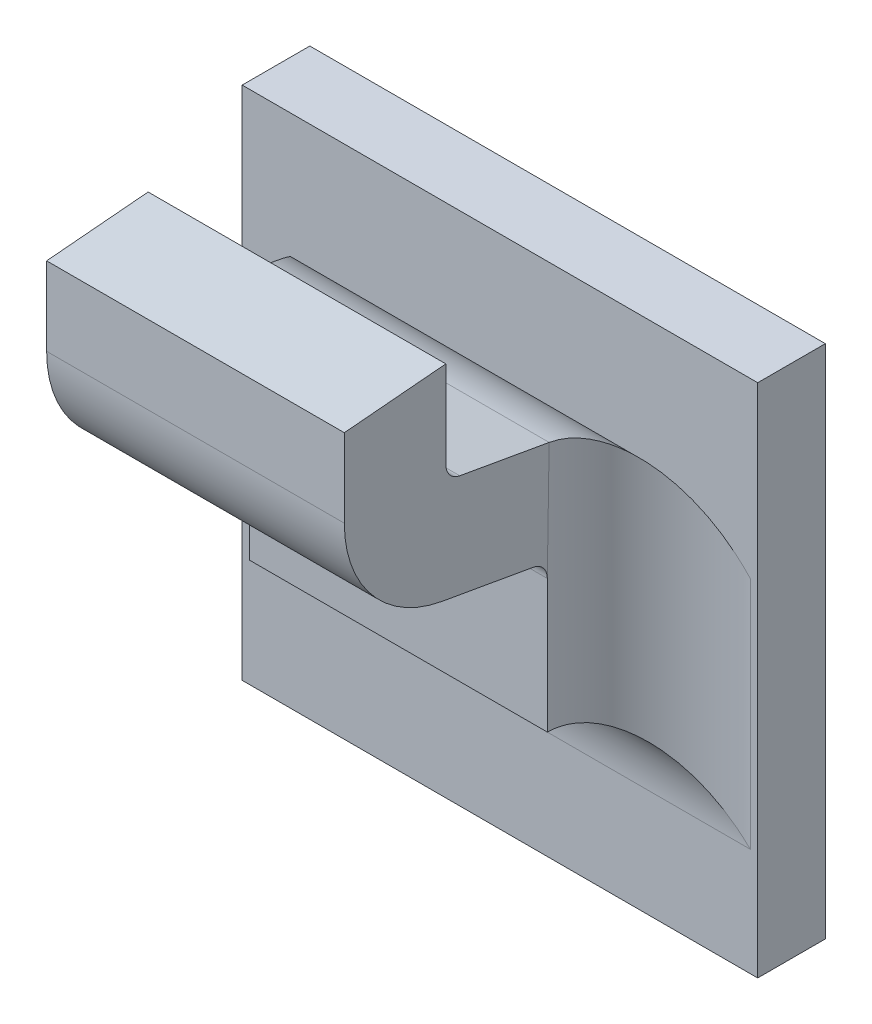
ISO-10303-21;
HEADER;
FILE_DESCRIPTION(('STEP AP214'),'2;1');
FILE_NAME('part.step','',(''),(''),'','','');
FILE_SCHEMA(('AUTOMOTIVE_DESIGN { 1 0 10303 214 1 1 1 1 }'));
ENDSEC;
DATA;
#1=APPLICATION_CONTEXT('core data for automotive mechanical design processes');
#2=APPLICATION_PROTOCOL_DEFINITION('international standard','automotive_design',2000,#1);
#3=PRODUCT_CONTEXT('',#1,'mechanical');
#4=PRODUCT('Part','Part','',(#3));
#5=PRODUCT_RELATED_PRODUCT_CATEGORY('part','',(#4));
#6=PRODUCT_DEFINITION_FORMATION('','',#4);
#7=PRODUCT_DEFINITION_CONTEXT('part definition',#1,'design');
#8=PRODUCT_DEFINITION('design','',#6,#7);
#9=PRODUCT_DEFINITION_SHAPE('','',#8);
#10=(LENGTH_UNIT() NAMED_UNIT(*) SI_UNIT(.MILLI.,.METRE.));
#11=(NAMED_UNIT(*) PLANE_ANGLE_UNIT() SI_UNIT($,.RADIAN.));
#12=(NAMED_UNIT(*) SI_UNIT($,.STERADIAN.) SOLID_ANGLE_UNIT());
#13=UNCERTAINTY_MEASURE_WITH_UNIT(LENGTH_MEASURE(1.E-05),#10,'distance_accuracy_value','');
#14=(GEOMETRIC_REPRESENTATION_CONTEXT(3) GLOBAL_UNCERTAINTY_ASSIGNED_CONTEXT((#13)) GLOBAL_UNIT_ASSIGNED_CONTEXT((#10,
#11,#12)) REPRESENTATION_CONTEXT('',''));
#15=CARTESIAN_POINT('',(0.,0.,0.));
#16=DIRECTION('',(0.,0.,1.));
#17=DIRECTION('',(1.,0.,0.));
#18=AXIS2_PLACEMENT_3D('',#15,#16,#17);
#19=CARTESIAN_POINT('',(0.804111518349957,-0.481298710143328,0.0797514586291467));
#20=DIRECTION('',(1.,0.,0.));
#21=DIRECTION('',(0.,1.,0.));
#22=AXIS2_PLACEMENT_3D('',#19,#20,#21);
#23=CYLINDRICAL_SURFACE('',#22,0.00098425196850394);
#24=DIRECTION('',(1.,0.,0.));
#25=VECTOR('',#24,1.);
#26=CARTESIAN_POINT('',(0.785056400239721,-0.481298710143328,0.0807357105976507));
#27=LINE('',#26,#25);
#28=CARTESIAN_POINT('',(0.803245376617673,-0.481298710143328,0.0807357105976507));
#29=VERTEX_POINT('',#28);
#30=CARTESIAN_POINT('',(0.785922541972004,-0.481298710143328,0.0807357105976507));
#31=VERTEX_POINT('',#30);
#32=EDGE_CURVE('E182',#29,#31,#27,.F.);
#33=ORIENTED_EDGE('',*,*,#32,.F.);
#34=CARTESIAN_POINT('',(0.803245376617673,-0.481298710143328,0.0797514586291467));
#35=DIRECTION('',(1.,0.,0.));
#36=DIRECTION('',(0.,1.,0.));
#37=AXIS2_PLACEMENT_3D('',#34,#35,#36);
#38=CIRCLE('',#37,0.00098425196850394);
#39=CARTESIAN_POINT('',(0.803245376617673,-0.482268009112829,0.0799223721898426));
#40=VERTEX_POINT('',#39);
#41=EDGE_CURVE('E155',#40,#29,#38,.F.);
#42=ORIENTED_EDGE('',*,*,#41,.F.);
#43=DIRECTION('',(1.,0.,0.));
#44=VECTOR('',#43,1.);
#45=CARTESIAN_POINT('',(0.785052207455063,-0.482268009112829,0.0799223721898425));
#46=LINE('',#45,#44);
#47=CARTESIAN_POINT('',(0.785922541972004,-0.482268009112829,0.0799223721898426));
#48=VERTEX_POINT('',#47);
#49=EDGE_CURVE('E137',#48,#40,#46,.T.);
#50=ORIENTED_EDGE('',*,*,#49,.F.);
#51=CARTESIAN_POINT('',(0.785922541972004,-0.481298710143328,0.0797514586291467));
#52=DIRECTION('',(1.,0.,0.));
#53=DIRECTION('',(0.,1.,0.));
#54=AXIS2_PLACEMENT_3D('',#51,#52,#53);
#55=CIRCLE('',#54,0.00098425196850394);
#56=EDGE_CURVE('E148',#48,#31,#55,.F.);
#57=ORIENTED_EDGE('',*,*,#56,.T.);
#58=EDGE_LOOP('',(#33,#42,#50,#57));
#59=FACE_BOUND('',#58,.T.);
#60=ADVANCED_FACE('F17',(#59),#23,.F.);
#61=CARTESIAN_POINT('',(0.785056400239721,-0.481552552937204,0.0807357105976507));
#62=DIRECTION('',(0.,0.,-1.));
#63=DIRECTION('',(0.,1.,0.));
#64=AXIS2_PLACEMENT_3D('',#61,#62,#63);
#65=PLANE('',#64);
#66=ORIENTED_EDGE('',*,*,#32,.T.);
#67=DIRECTION('',(0.,1.,0.));
#68=VECTOR('',#67,1.);
#69=CARTESIAN_POINT('',(0.785922541972004,-0.490676723073834,0.0807357105976507));
#70=LINE('',#69,#68);
#71=CARTESIAN_POINT('',(0.785922541972004,-0.476221854265821,0.0807357105976507));
#72=VERTEX_POINT('',#71);
#73=EDGE_CURVE('E177',#31,#72,#70,.T.);
#74=ORIENTED_EDGE('',*,*,#73,.T.);
#75=DIRECTION('',(1.,0.,0.));
#76=VECTOR('',#75,1.);
#77=CARTESIAN_POINT('',(0.832083959294839,-0.476221854265822,0.0807357105976506));
#78=LINE('',#77,#76);
#79=CARTESIAN_POINT('',(0.803245376617673,-0.476221854265821,0.0807357105976507));
#80=VERTEX_POINT('',#79);
#81=EDGE_CURVE('E170',#72,#80,#78,.T.);
#82=ORIENTED_EDGE('',*,*,#81,.T.);
#83=DIRECTION('',(0.,1.,0.));
#84=VECTOR('',#83,1.);
#85=CARTESIAN_POINT('',(0.803245376617673,-0.490676723073834,0.0807357105976507));
#86=LINE('',#85,#84);
#87=EDGE_CURVE('E189',#29,#80,#86,.T.);
#88=ORIENTED_EDGE('',*,*,#87,.F.);
#89=EDGE_LOOP('',(#66,#74,#82,#88));
#90=FACE_BOUND('',#89,.T.);
#91=ADVANCED_FACE('F376',(#90),#65,.T.);
#92=CARTESIAN_POINT('',(0.832083959294839,-0.476580451683761,0.0848344978403345));
#93=DIRECTION('',(0.,-0.996194698091746,-0.0871557427476516));
#94=DIRECTION('',(0.,0.0871557427476516,-0.996194698091746));
#95=AXIS2_PLACEMENT_3D('',#92,#93,#94);
#96=PLANE('',#95);
#97=DIRECTION('',(0.,-0.0871557427476629,0.996194698091745));
#98=VECTOR('',#97,1.);
#99=CARTESIAN_POINT('',(0.785922541972004,-0.476221854265821,0.0807357105976507));
#100=LINE('',#99,#98);
#101=CARTESIAN_POINT('',(0.785922541972004,-0.476738519601604,0.0866412224086743));
#102=VERTEX_POINT('',#101);
#103=EDGE_CURVE('E173',#72,#102,#100,.T.);
#104=ORIENTED_EDGE('',*,*,#103,.T.);
#105=DIRECTION('',(1.,0.,0.));
#106=VECTOR('',#105,1.);
#107=CARTESIAN_POINT('',(0.785056400239721,-0.476738519601604,0.0866412224086743));
#108=LINE('',#107,#106);
#109=CARTESIAN_POINT('',(0.803245376617673,-0.476738519601604,0.0866412224086743));
#110=VERTEX_POINT('',#109);
#111=EDGE_CURVE('E167',#102,#110,#108,.T.);
#112=ORIENTED_EDGE('',*,*,#111,.T.);
#113=DIRECTION('',(0.,-0.0871557427476629,0.996194698091745));
#114=VECTOR('',#113,1.);
#115=CARTESIAN_POINT('',(0.803245376617673,-0.476221854265821,0.0807357105976507));
#116=LINE('',#115,#114);
#117=EDGE_CURVE('E186',#80,#110,#116,.T.);
#118=ORIENTED_EDGE('',*,*,#117,.F.);
#119=ORIENTED_EDGE('',*,*,#81,.F.);
#120=EDGE_LOOP('',(#104,#112,#118,#119));
#121=FACE_BOUND('',#120,.T.);
#122=ADVANCED_FACE('F380',(#121),#96,.F.);
#123=CARTESIAN_POINT('',(0.785056400239721,-0.481526719670415,0.0866412224086743));
#124=DIRECTION('',(0.,0.,-1.));
#125=DIRECTION('',(0.,1.,0.));
#126=AXIS2_PLACEMENT_3D('',#123,#124,#125);
#127=PLANE('',#126);
#128=ORIENTED_EDGE('',*,*,#111,.F.);
#129=DIRECTION('',(0.,1.,0.));
#130=VECTOR('',#129,1.);
#131=CARTESIAN_POINT('',(0.785922541972004,-0.490676723073834,0.0866412224086743));
#132=LINE('',#131,#130);
#133=CARTESIAN_POINT('',(0.785922541972004,-0.481298710143328,0.0866412224086743));
#134=VERTEX_POINT('',#133);
#135=EDGE_CURVE('E176',#102,#134,#132,.F.);
#136=ORIENTED_EDGE('',*,*,#135,.T.);
#137=DIRECTION('',(1.,0.,0.));
#138=VECTOR('',#137,1.);
#139=CARTESIAN_POINT('',(0.804111518349957,-0.481298710143328,0.0866412224086743));
#140=LINE('',#139,#138);
#141=CARTESIAN_POINT('',(0.803245376617673,-0.481298710143328,0.0866412224086743));
#142=VERTEX_POINT('',#141);
#143=EDGE_CURVE('E165',#142,#134,#140,.F.);
#144=ORIENTED_EDGE('',*,*,#143,.F.);
#145=DIRECTION('',(0.,1.,0.));
#146=VECTOR('',#145,1.);
#147=CARTESIAN_POINT('',(0.803245376617673,-0.490676723073834,0.0866412224086743));
#148=LINE('',#147,#146);
#149=EDGE_CURVE('E188',#110,#142,#148,.F.);
#150=ORIENTED_EDGE('',*,*,#149,.F.);
#151=EDGE_LOOP('',(#128,#136,#144,#150));
#152=FACE_BOUND('',#151,.T.);
#153=ADVANCED_FACE('F384',(#152),#127,.F.);
#154=CARTESIAN_POINT('',(0.804111518349957,-0.481298710143328,0.0797514586291467));
#155=DIRECTION('',(1.,0.,0.));
#156=DIRECTION('',(0.,1.,0.));
#157=AXIS2_PLACEMENT_3D('',#154,#155,#156);
#158=CYLINDRICAL_SURFACE('',#157,0.00688976377952756);
#159=CARTESIAN_POINT('',(0.803245376617673,-0.481298710143328,0.0797514586291467));
#160=DIRECTION('',(1.,0.,0.));
#161=DIRECTION('',(0.,1.,0.));
#162=AXIS2_PLACEMENT_3D('',#159,#160,#161);
#163=CIRCLE('',#162,0.00688976377952756);
#164=CARTESIAN_POINT('',(0.803245376617673,-0.48808380292983,0.0809478535540176));
#165=VERTEX_POINT('',#164);
#166=EDGE_CURVE('E146',#142,#165,#163,.T.);
#167=ORIENTED_EDGE('',*,*,#166,.F.);
#168=ORIENTED_EDGE('',*,*,#143,.T.);
#169=CARTESIAN_POINT('',(0.785922541972004,-0.481298710143328,0.0797514586291467));
#170=DIRECTION('',(1.,0.,0.));
#171=DIRECTION('',(0.,1.,0.));
#172=AXIS2_PLACEMENT_3D('',#169,#170,#171);
#173=CIRCLE('',#172,0.00688976377952756);
#174=CARTESIAN_POINT('',(0.785922541972004,-0.48808380292983,0.0809478535540176));
#175=VERTEX_POINT('',#174);
#176=EDGE_CURVE('E235',#134,#175,#173,.T.);
#177=ORIENTED_EDGE('',*,*,#176,.T.);
#178=DIRECTION('',(1.,0.,0.));
#179=VECTOR('',#178,1.);
#180=CARTESIAN_POINT('',(0.785056400239721,-0.48808380292983,0.0809478535540173));
#181=LINE('',#180,#179);
#182=EDGE_CURVE('E138',#175,#165,#181,.T.);
#183=ORIENTED_EDGE('',*,*,#182,.T.);
#184=EDGE_LOOP('',(#167,#168,#177,#183));
#185=FACE_BOUND('',#184,.T.);
#186=ADVANCED_FACE('F388',(#185),#158,.T.);
#187=CARTESIAN_POINT('',(0.785056400239721,-0.489065861722658,0.075378321376456));
#188=DIRECTION('',(0.,0.984807753012208,-0.17364817766693));
#189=DIRECTION('',(0.,0.17364817766693,0.984807753012208));
#190=AXIS2_PLACEMENT_3D('',#187,#188,#189);
#191=PLANE('',#190);
#192=DIRECTION('',(1.,0.,0.));
#193=VECTOR('',#192,1.);
#194=CARTESIAN_POINT('',(0.804111518349957,-0.489019097018238,0.0756435371944352));
#195=LINE('',#194,#193);
#196=CARTESIAN_POINT('',(0.785922541972004,-0.489019097018238,0.0756435371944351));
#197=VERTEX_POINT('',#196);
#198=CARTESIAN_POINT('',(0.803245376617673,-0.489019097018238,0.0756435371944351));
#199=VERTEX_POINT('',#198);
#200=EDGE_CURVE('E127',#197,#199,#195,.T.);
#201=ORIENTED_EDGE('',*,*,#200,.T.);
#202=DIRECTION('',(0.,-0.173648177666998,-0.984807753012196));
#203=VECTOR('',#202,1.);
#204=CARTESIAN_POINT('',(0.803245376617673,-0.48808380292983,0.0809478535540173));
#205=LINE('',#204,#203);
#206=EDGE_CURVE('E130',#165,#199,#205,.T.);
#207=ORIENTED_EDGE('',*,*,#206,.F.);
#208=ORIENTED_EDGE('',*,*,#182,.F.);
#209=DIRECTION('',(0.,-0.173648177666998,-0.984807753012196));
#210=VECTOR('',#209,1.);
#211=CARTESIAN_POINT('',(0.785922541972004,-0.48808380292983,0.0809478535540173));
#212=LINE('',#211,#210);
#213=EDGE_CURVE('E132',#175,#197,#212,.T.);
#214=ORIENTED_EDGE('',*,*,#213,.T.);
#215=EDGE_LOOP('',(#201,#207,#208,#214));
#216=FACE_BOUND('',#215,.T.);
#217=ADVANCED_FACE('F129',(#216),#191,.F.);
#218=CARTESIAN_POINT('',(0.804111518349957,-0.489988395987738,0.0758144507551309));
#219=DIRECTION('',(1.,0.,0.));
#220=DIRECTION('',(0.,1.,0.));
#221=AXIS2_PLACEMENT_3D('',#218,#219,#220);
#222=CYLINDRICAL_SURFACE('',#221,0.00098425196850394);
#223=DIRECTION('',(1.,0.,0.));
#224=VECTOR('',#223,1.);
#225=CARTESIAN_POINT('',(0.785056400239721,-0.489988395987738,0.074830198786627));
#226=LINE('',#225,#224);
#227=CARTESIAN_POINT('',(0.785922541972004,-0.489988395987738,0.074830198786627));
#228=VERTEX_POINT('',#227);
#229=CARTESIAN_POINT('',(0.803245376617673,-0.489988395987738,0.074830198786627));
#230=VERTEX_POINT('',#229);
#231=EDGE_CURVE('E151',#228,#230,#226,.T.);
#232=ORIENTED_EDGE('',*,*,#231,.T.);
#233=CARTESIAN_POINT('',(0.803245376617673,-0.489988395987738,0.0758144507551309));
#234=DIRECTION('',(1.,0.,0.));
#235=DIRECTION('',(0.,1.,0.));
#236=AXIS2_PLACEMENT_3D('',#233,#234,#235);
#237=CIRCLE('',#236,0.00098425196850394);
#238=EDGE_CURVE('E20',#199,#230,#237,.F.);
#239=ORIENTED_EDGE('',*,*,#238,.F.);
#240=ORIENTED_EDGE('',*,*,#200,.F.);
#241=CARTESIAN_POINT('',(0.785922541972004,-0.489988395987738,0.0758144507551309));
#242=DIRECTION('',(1.,0.,0.));
#243=DIRECTION('',(0.,1.,0.));
#244=AXIS2_PLACEMENT_3D('',#241,#242,#243);
#245=CIRCLE('',#244,0.00098425196850394);
#246=EDGE_CURVE('E232',#197,#228,#245,.F.);
#247=ORIENTED_EDGE('',*,*,#246,.T.);
#248=EDGE_LOOP('',(#232,#239,#240,#247));
#249=FACE_BOUND('',#248,.T.);
#250=ADVANCED_FACE('F150',(#249),#222,.F.);
#251=CARTESIAN_POINT('',(0.785052207455063,-0.483250067905657,0.0743528400122813));
#252=DIRECTION('',(0.,0.984807753012208,-0.17364817766693));
#253=DIRECTION('',(0.,0.17364817766693,0.984807753012208));
#254=AXIS2_PLACEMENT_3D('',#251,#252,#253);
#255=PLANE('',#254);
#256=DIRECTION('',(0.,0.173648177666945,0.984807753012206));
#257=VECTOR('',#256,1.);
#258=CARTESIAN_POINT('',(0.803245376617673,-0.483165896674262,0.074830198786627));
#259=LINE('',#258,#257);
#260=CARTESIAN_POINT('',(0.803247282428882,-0.483184599937749,0.0747241273084437));
#261=VERTEX_POINT('',#260);
#262=EDGE_CURVE('E153',#261,#40,#259,.T.);
#263=ORIENTED_EDGE('',*,*,#262,.F.);
#264=DIRECTION('',(1.,0.,0.));
#265=VECTOR('',#264,1.);
#266=CARTESIAN_POINT('',(0.810607581342083,-0.483203303201237,0.0746180558302605));
#267=LINE('',#266,#265);
#268=CARTESIAN_POINT('',(0.785920636160796,-0.483184599937749,0.0747241273084437));
#269=VERTEX_POINT('',#268);
#270=EDGE_CURVE('E264',#269,#261,#267,.T.);
#271=ORIENTED_EDGE('',*,*,#270,.F.);
#272=DIRECTION('',(0.,0.173648177666945,0.984807753012206));
#273=VECTOR('',#272,1.);
#274=CARTESIAN_POINT('',(0.785922541972004,-0.483165896674262,0.074830198786627));
#275=LINE('',#274,#273);
#276=EDGE_CURVE('E234',#269,#48,#275,.T.);
#277=ORIENTED_EDGE('',*,*,#276,.T.);
#278=ORIENTED_EDGE('',*,*,#49,.T.);
#279=EDGE_LOOP('',(#263,#271,#277,#278));
#280=FACE_BOUND('',#279,.T.);
#281=ADVANCED_FACE('F373',(#280),#255,.T.);
#282=CARTESIAN_POINT('',(0.803245376617673,-0.490676723073834,0.0742396476055247));
#283=DIRECTION('',(1.,0.,0.));
#284=DIRECTION('',(0.,1.,0.));
#285=AXIS2_PLACEMENT_3D('',#282,#283,#284);
#286=PLANE('',#285);
#287=ORIENTED_EDGE('',*,*,#166,.T.);
#288=ORIENTED_EDGE('',*,*,#206,.T.);
#289=ORIENTED_EDGE('',*,*,#238,.T.);
#290=DIRECTION('',(0.,-1.,0.));
#291=VECTOR('',#290,1.);
#292=CARTESIAN_POINT('',(0.803245376617673,-0.504660414832431,0.074830198786627));
#293=LINE('',#292,#291);
#294=EDGE_CURVE('E271',#230,#261,#293,.F.);
#295=ORIENTED_EDGE('',*,*,#294,.T.);
#296=ORIENTED_EDGE('',*,*,#262,.T.);
#297=ORIENTED_EDGE('',*,*,#41,.T.);
#298=ORIENTED_EDGE('',*,*,#87,.T.);
#299=ORIENTED_EDGE('',*,*,#117,.T.);
#300=ORIENTED_EDGE('',*,*,#149,.T.);
#301=EDGE_LOOP('',(#287,#288,#289,#295,#296,#297,#298,#299,#300));
#302=FACE_BOUND('',#301,.T.);
#303=ADVANCED_FACE('F142',(#302),#286,.T.);
#304=CARTESIAN_POINT('',(0.785922541972004,-0.490676723073834,0.0742396476055247));
#305=DIRECTION('',(1.,0.,0.));
#306=DIRECTION('',(0.,1.,0.));
#307=AXIS2_PLACEMENT_3D('',#304,#305,#306);
#308=PLANE('',#307);
#309=DIRECTION('',(0.,1.,0.));
#310=VECTOR('',#309,1.);
#311=CARTESIAN_POINT('',(0.785922541972005,-0.482142348190539,0.074830198786627));
#312=LINE('',#311,#310);
#313=EDGE_CURVE('E290',#269,#228,#312,.F.);
#314=ORIENTED_EDGE('',*,*,#313,.T.);
#315=ORIENTED_EDGE('',*,*,#246,.F.);
#316=ORIENTED_EDGE('',*,*,#213,.F.);
#317=ORIENTED_EDGE('',*,*,#176,.F.);
#318=ORIENTED_EDGE('',*,*,#135,.F.);
#319=ORIENTED_EDGE('',*,*,#103,.F.);
#320=ORIENTED_EDGE('',*,*,#73,.F.);
#321=ORIENTED_EDGE('',*,*,#56,.F.);
#322=ORIENTED_EDGE('',*,*,#276,.F.);
#323=EDGE_LOOP('',(#314,#315,#316,#317,#318,#319,#320,#321,#322));
#324=FACE_BOUND('',#323,.T.);
#325=ADVANCED_FACE('F371',(#324),#308,.F.);
#326=CARTESIAN_POINT('',(0.785056400239721,-0.498118502465182,0.074830198786627));
#327=DIRECTION('',(0.,0.,-1.));
#328=DIRECTION('',(0.,1.,0.));
#329=AXIS2_PLACEMENT_3D('',#326,#327,#328);
#330=PLANE('',#329);
#331=DIRECTION('',(-1.,0.,0.));
#332=VECTOR('',#331,1.);
#333=CARTESIAN_POINT('',(0.778560337247595,-0.497731354537685,0.074830198786627));
#334=LINE('',#333,#332);
#335=CARTESIAN_POINT('',(0.785922541972005,-0.497731354537685,0.074830198786627));
#336=VERTEX_POINT('',#335);
#337=CARTESIAN_POINT('',(0.803245376617673,-0.497731354537685,0.074830198786627));
#338=VERTEX_POINT('',#337);
#339=EDGE_CURVE('E275',#336,#338,#334,.F.);
#340=ORIENTED_EDGE('',*,*,#339,.T.);
#341=DIRECTION('',(0.,-1.,0.));
#342=VECTOR('',#341,1.);
#343=CARTESIAN_POINT('',(0.803245376617673,-0.504660414832431,0.074830198786627));
#344=LINE('',#343,#342);
#345=EDGE_CURVE('E268',#338,#230,#344,.F.);
#346=ORIENTED_EDGE('',*,*,#345,.T.);
#347=ORIENTED_EDGE('',*,*,#231,.F.);
#348=DIRECTION('',(0.,1.,0.));
#349=VECTOR('',#348,1.);
#350=CARTESIAN_POINT('',(0.785922541972005,-0.482142348190539,0.074830198786627));
#351=LINE('',#350,#349);
#352=EDGE_CURVE('E293',#228,#336,#351,.F.);
#353=ORIENTED_EDGE('',*,*,#352,.T.);
#354=EDGE_LOOP('',(#340,#346,#347,#353));
#355=FACE_BOUND('',#354,.T.);
#356=ADVANCED_FACE('F369',(#355),#330,.F.);
#357=CARTESIAN_POINT('',(0.810607581342083,-0.489988395987738,0.0758144507551309));
#358=DIRECTION('',(1.,0.,0.));
#359=DIRECTION('',(0.,1.,0.));
#360=AXIS2_PLACEMENT_3D('',#357,#358,#359);
#361=CYLINDRICAL_SURFACE('',#360,0.00688976377952756);
#362=ORIENTED_EDGE('',*,*,#270,.T.);
#363=CARTESIAN_POINT('',(0.803246382593822,-0.483185488579863,0.0747242535477702));
#364=CARTESIAN_POINT('',(0.803251281941989,-0.483232266027787,0.0744293553553975));
#365=CARTESIAN_POINT('',(0.803278884572725,-0.483298823939585,0.0741391660738234));
#366=CARTESIAN_POINT('',(0.803372824924848,-0.483465339173825,0.0735779766513714));
#367=CARTESIAN_POINT('',(0.803438794444158,-0.483564975201296,0.073306821195812));
#368=CARTESIAN_POINT('',(0.803602778162369,-0.483792090427846,0.0727887375004896));
#369=CARTESIAN_POINT('',(0.803700655286948,-0.483919449764025,0.0725417113993396));
#370=CARTESIAN_POINT('',(0.80392225674358,-0.484196815183936,0.0720726852306902));
#371=CARTESIAN_POINT('',(0.804046047828158,-0.484346879471711,0.071850752120349));
#372=CARTESIAN_POINT('',(0.804382315788507,-0.484745897905248,0.071326423454796));
#373=CARTESIAN_POINT('',(0.804607765363316,-0.485006169183649,0.0710409452665381));
#374=CARTESIAN_POINT('',(0.805089841992869,-0.485553804988474,0.0705281886247574));
#375=CARTESIAN_POINT('',(0.805346540514468,-0.485841231269787,0.0703010474198589));
#376=CARTESIAN_POINT('',(0.805980590718541,-0.486544894865211,0.0698267645837302));
#377=CARTESIAN_POINT('',(0.806367179348041,-0.486969125966213,0.0696038752443972));
#378=CARTESIAN_POINT('',(0.807161035516566,-0.487835246032007,0.0692531254101266));
#379=CARTESIAN_POINT('',(0.807568287311545,-0.488277121499792,0.0691251936913979));
#380=CARTESIAN_POINT('',(0.808249955199605,-0.489015004077301,0.0689873300019178));
#381=CARTESIAN_POINT('',(0.808521835079522,-0.489308858114222,0.06895193709532));
#382=CARTESIAN_POINT('',(0.808913068498066,-0.489731521036954,0.0689282813392202));
#383=CARTESIAN_POINT('',(0.809031983925357,-0.48985996419474,0.0689246964591274));
#384=CARTESIAN_POINT('',(0.809150888428697,-0.489988395987738,0.0689246869756034));
#385=B_SPLINE_CURVE_WITH_KNOTS('',3,(#363,#364,#365,#366,#367,#368,#369,#370,#371,#372,#373,
#374,#375,#376,#377,#378,#379,#380,#381,#382,#383,#384),.UNSPECIFIED.,.F.,.F.,(4,2,2,2,2,2,2,2,
2,2,4),(0.,0.000892674275674722,0.00177691981761756,0.00265741564566986,0.00354020811045539,
0.00487460341316188,0.00621210995073968,0.00804949445936676,0.00988549942521242,0.011089431284,
0.0116145091100796),.UNSPECIFIED.);
#386=CARTESIAN_POINT('',(0.809150888428697,-0.489988395987738,0.0689246869756034));
#387=VERTEX_POINT('',#386);
#388=EDGE_CURVE('E231',#261,#387,#385,.T.);
#389=ORIENTED_EDGE('',*,*,#388,.T.);
#390=DIRECTION('',(1.,0.,0.));
#391=VECTOR('',#390,1.);
#392=CARTESIAN_POINT('',(0.778083959294839,-0.489988395987738,0.0689246869756034));
#393=LINE('',#392,#391);
#394=CARTESIAN_POINT('',(0.780017030160981,-0.489988395987738,0.0689246869756034));
#395=VERTEX_POINT('',#394);
#396=EDGE_CURVE('E195',#395,#387,#393,.T.);
#397=ORIENTED_EDGE('',*,*,#396,.F.);
#398=CARTESIAN_POINT('',(0.785921535995856,-0.483185488579863,0.0747242535477702));
#399=CARTESIAN_POINT('',(0.785916636647689,-0.483232266027787,0.0744293553553975));
#400=CARTESIAN_POINT('',(0.785889034016953,-0.483298823939585,0.0741391660738235));
#401=CARTESIAN_POINT('',(0.78579509366483,-0.483465339173825,0.0735779766513714));
#402=CARTESIAN_POINT('',(0.78572912414552,-0.483564975201296,0.073306821195812));
#403=CARTESIAN_POINT('',(0.785565140427309,-0.483792090427847,0.0727887375004896));
#404=CARTESIAN_POINT('',(0.78546726330273,-0.483919449764025,0.0725417113993395));
#405=CARTESIAN_POINT('',(0.785245661846098,-0.484196815183936,0.0720726852306902));
#406=CARTESIAN_POINT('',(0.78512187076152,-0.484346879471711,0.071850752120349));
#407=CARTESIAN_POINT('',(0.784785602801171,-0.484745897905248,0.071326423454796));
#408=CARTESIAN_POINT('',(0.784560153226362,-0.485006169183649,0.0710409452665381));
#409=CARTESIAN_POINT('',(0.784078076596809,-0.485553804988474,0.0705281886247574));
#410=CARTESIAN_POINT('',(0.78382137807521,-0.485841231269787,0.0703010474198589));
#411=CARTESIAN_POINT('',(0.783187327871138,-0.486544894865211,0.0698267645837302));
#412=CARTESIAN_POINT('',(0.782800739241637,-0.486969125966213,0.0696038752443972));
#413=CARTESIAN_POINT('',(0.782006883073112,-0.487835246032007,0.0692531254101267));
#414=CARTESIAN_POINT('',(0.781599631278133,-0.488277121499792,0.0691251936913979));
#415=CARTESIAN_POINT('',(0.780917963390073,-0.489015004077301,0.0689873300019178));
#416=CARTESIAN_POINT('',(0.780646083510156,-0.489308858114222,0.06895193709532));
#417=CARTESIAN_POINT('',(0.780254850091612,-0.489731521036954,0.0689282813392202));
#418=CARTESIAN_POINT('',(0.780135934664321,-0.48985996419474,0.0689246964591274));
#419=CARTESIAN_POINT('',(0.780017030160981,-0.489988395987738,0.0689246869756034));
#420=B_SPLINE_CURVE_WITH_KNOTS('',3,(#398,#399,#400,#401,#402,#403,#404,#405,#406,#407,#408,
#409,#410,#411,#412,#413,#414,#415,#416,#417,#418,#419),.UNSPECIFIED.,.F.,.F.,(4,2,2,2,2,2,2,2,
2,2,4),(0.,0.000892674275674695,0.00177691981761756,0.00265741564566996,0.0035402081104554,
0.0048746034131619,0.00621210995073963,0.00804949445936662,0.00988549942521236,
0.0110894312840001,0.0116145091100796),.UNSPECIFIED.);
#421=EDGE_CURVE('E192',#395,#269,#420,.F.);
#422=ORIENTED_EDGE('',*,*,#421,.T.);
#423=EDGE_LOOP('',(#362,#389,#397,#422));
#424=FACE_BOUND('',#423,.T.);
#425=ADVANCED_FACE('F205',(#424),#361,.T.);
#426=CARTESIAN_POINT('',(0.809150888428697,-0.504660414832431,0.074830198786627));
#427=DIRECTION('',(0.,-1.,0.));
#428=DIRECTION('',(1.,0.,0.));
#429=AXIS2_PLACEMENT_3D('',#426,#427,#428);
#430=CYLINDRICAL_SURFACE('',#429,0.00590551181102362);
#431=ORIENTED_EDGE('',*,*,#345,.F.);
#432=CARTESIAN_POINT('',(0.809150888428697,-0.503636866348709,0.074830198786627));
#433=DIRECTION('',(-0.707106781186548,-0.707106781186547,0.));
#434=DIRECTION('',(0.707106781186547,-0.707106781186548,0.));
#435=AXIS2_PLACEMENT_3D('',#432,#433,#434);
#436=ELLIPSE('',#435,0.0083516548959041,0.00590551181102362);
#437=CARTESIAN_POINT('',(0.809150888428697,-0.503636866348709,0.0689246869756034));
#438=VERTEX_POINT('',#437);
#439=EDGE_CURVE('E281',#338,#438,#436,.T.);
#440=ORIENTED_EDGE('',*,*,#439,.T.);
#441=DIRECTION('',(0.,-1.,0.));
#442=VECTOR('',#441,1.);
#443=CARTESIAN_POINT('',(0.809150888428697,-0.478408111823491,0.0689246869756034));
#444=LINE('',#443,#442);
#445=EDGE_CURVE('E276',#387,#438,#444,.T.);
#446=ORIENTED_EDGE('',*,*,#445,.F.);
#447=ORIENTED_EDGE('',*,*,#388,.F.);
#448=ORIENTED_EDGE('',*,*,#294,.F.);
#449=EDGE_LOOP('',(#431,#440,#446,#447,#448));
#450=FACE_BOUND('',#449,.T.);
#451=ADVANCED_FACE('F219',(#450),#430,.F.);
#452=CARTESIAN_POINT('',(0.778560337247595,-0.503636866348709,0.074830198786627));
#453=DIRECTION('',(-1.,0.,0.));
#454=DIRECTION('',(0.,-1.,0.));
#455=AXIS2_PLACEMENT_3D('',#452,#453,#454);
#456=CYLINDRICAL_SURFACE('',#455,0.00590551181102362);
#457=DIRECTION('',(1.,0.,0.));
#458=VECTOR('',#457,1.);
#459=CARTESIAN_POINT('',(0.778083959294839,-0.503636866348709,0.0689246869756034));
#460=LINE('',#459,#458);
#461=CARTESIAN_POINT('',(0.780017030160981,-0.503636866348709,0.0689246869756034));
#462=VERTEX_POINT('',#461);
#463=EDGE_CURVE('E278',#438,#462,#460,.F.);
#464=ORIENTED_EDGE('',*,*,#463,.F.);
#465=ORIENTED_EDGE('',*,*,#439,.F.);
#466=ORIENTED_EDGE('',*,*,#339,.F.);
#467=CARTESIAN_POINT('',(0.780017030160981,-0.503636866348709,0.074830198786627));
#468=DIRECTION('',(-0.707106781186547,0.707106781186548,0.));
#469=DIRECTION('',(-0.707106781186548,-0.707106781186547,0.));
#470=AXIS2_PLACEMENT_3D('',#467,#468,#469);
#471=ELLIPSE('',#470,0.0083516548959041,0.00590551181102362);
#472=EDGE_CURVE('E196',#336,#462,#471,.T.);
#473=ORIENTED_EDGE('',*,*,#472,.T.);
#474=EDGE_LOOP('',(#464,#465,#466,#473));
#475=FACE_BOUND('',#474,.T.);
#476=ADVANCED_FACE('F215',(#475),#456,.F.);
#477=CARTESIAN_POINT('',(0.780017030160981,-0.482142348190539,0.074830198786627));
#478=DIRECTION('',(0.,1.,0.));
#479=DIRECTION('',(-1.,0.,0.));
#480=AXIS2_PLACEMENT_3D('',#477,#478,#479);
#481=CYLINDRICAL_SURFACE('',#480,0.00590551181102362);
#482=DIRECTION('',(0.,-1.,0.));
#483=VECTOR('',#482,1.);
#484=CARTESIAN_POINT('',(0.780017030160981,-0.478408111823491,0.0689246869756034));
#485=LINE('',#484,#483);
#486=EDGE_CURVE('E283',#462,#395,#485,.F.);
#487=ORIENTED_EDGE('',*,*,#486,.F.);
#488=ORIENTED_EDGE('',*,*,#472,.F.);
#489=ORIENTED_EDGE('',*,*,#352,.F.);
#490=ORIENTED_EDGE('',*,*,#313,.F.);
#491=ORIENTED_EDGE('',*,*,#421,.F.);
#492=EDGE_LOOP('',(#487,#488,#489,#490,#491));
#493=FACE_BOUND('',#492,.T.);
#494=ADVANCED_FACE('F209',(#493),#481,.F.);
#495=CARTESIAN_POINT('',(0.778083959294839,-0.478408111823491,0.0689246869756034));
#496=DIRECTION('',(0.,0.,1.));
#497=DIRECTION('',(0.,-1.,0.));
#498=AXIS2_PLACEMENT_3D('',#495,#496,#497);
#499=PLANE('',#498);
#500=ORIENTED_EDGE('',*,*,#463,.T.);
#501=ORIENTED_EDGE('',*,*,#486,.T.);
#502=ORIENTED_EDGE('',*,*,#396,.T.);
#503=ORIENTED_EDGE('',*,*,#445,.T.);
#504=EDGE_LOOP('',(#500,#501,#502,#503));
#505=FACE_BOUND('',#504,.T.);
#506=DIRECTION('',(0.,-1.,0.));
#507=VECTOR('',#506,1.);
#508=CARTESIAN_POINT('',(0.809583959294839,-0.478408111823491,0.0689246869756034));
#509=LINE('',#508,#507);
#510=CARTESIAN_POINT('',(0.809583959294839,-0.509908111823491,0.0689246869756034));
#511=VERTEX_POINT('',#510);
#512=CARTESIAN_POINT('',(0.809583959294839,-0.479908111823491,0.0689246869756034));
#513=VERTEX_POINT('',#512);
#514=EDGE_CURVE('E300',#511,#513,#509,.F.);
#515=ORIENTED_EDGE('',*,*,#514,.T.);
#516=DIRECTION('',(1.,0.,0.));
#517=VECTOR('',#516,1.);
#518=CARTESIAN_POINT('',(0.778083959294839,-0.479908111823491,0.0689246869756034));
#519=LINE('',#518,#517);
#520=CARTESIAN_POINT('',(0.779583959294839,-0.479908111823491,0.0689246869756034));
#521=VERTEX_POINT('',#520);
#522=EDGE_CURVE('E305',#513,#521,#519,.F.);
#523=ORIENTED_EDGE('',*,*,#522,.T.);
#524=DIRECTION('',(0.,1.,0.));
#525=VECTOR('',#524,1.);
#526=CARTESIAN_POINT('',(0.779583959294839,-0.511408111823491,0.0689246869756034));
#527=LINE('',#526,#525);
#528=CARTESIAN_POINT('',(0.779583959294839,-0.509908111823491,0.0689246869756034));
#529=VERTEX_POINT('',#528);
#530=EDGE_CURVE('E308',#521,#529,#527,.F.);
#531=ORIENTED_EDGE('',*,*,#530,.T.);
#532=DIRECTION('',(-1.,0.,0.));
#533=VECTOR('',#532,1.);
#534=CARTESIAN_POINT('',(0.811083959294839,-0.509908111823491,0.0689246869756034));
#535=LINE('',#534,#533);
#536=EDGE_CURVE('E286',#529,#511,#535,.F.);
#537=ORIENTED_EDGE('',*,*,#536,.T.);
#538=EDGE_LOOP('',(#515,#523,#531,#537));
#539=FACE_BOUND('',#538,.T.);
#540=ADVANCED_FACE('F214',(#505,#539),#499,.T.);
#541=CARTESIAN_POINT('',(0.811083959294839,-0.509908111823491,0.0647908287078869));
#542=DIRECTION('',(0.,1.,0.));
#543=DIRECTION('',(-1.,0.,0.));
#544=AXIS2_PLACEMENT_3D('',#541,#542,#543);
#545=PLANE('',#544);
#546=DIRECTION('',(0.,0.,1.));
#547=VECTOR('',#546,1.);
#548=CARTESIAN_POINT('',(0.809583959294839,-0.509908111823491,0.0647908287078869));
#549=LINE('',#548,#547);
#550=CARTESIAN_POINT('',(0.809583959294839,-0.509908111823491,0.0649876791015876));
#551=VERTEX_POINT('',#550);
#552=EDGE_CURVE('E297',#551,#511,#549,.T.);
#553=ORIENTED_EDGE('',*,*,#552,.T.);
#554=ORIENTED_EDGE('',*,*,#536,.F.);
#555=DIRECTION('',(0.,0.,1.));
#556=VECTOR('',#555,1.);
#557=CARTESIAN_POINT('',(0.779583959294839,-0.509908111823491,0.0647908287078869));
#558=LINE('',#557,#556);
#559=CARTESIAN_POINT('',(0.779583959294839,-0.509908111823491,0.0649876791015876));
#560=VERTEX_POINT('',#559);
#561=EDGE_CURVE('E311',#529,#560,#558,.F.);
#562=ORIENTED_EDGE('',*,*,#561,.T.);
#563=DIRECTION('',(1.,0.,0.));
#564=VECTOR('',#563,1.);
#565=CARTESIAN_POINT('',(0.778083959294839,-0.509908111823491,0.0649876791015877));
#566=LINE('',#565,#564);
#567=EDGE_CURVE('E314',#560,#551,#566,.T.);
#568=ORIENTED_EDGE('',*,*,#567,.T.);
#569=EDGE_LOOP('',(#553,#554,#562,#568));
#570=FACE_BOUND('',#569,.T.);
#571=ADVANCED_FACE('F332',(#570),#545,.F.);
#572=CARTESIAN_POINT('',(0.809583959294839,-0.478408111823491,0.0647908287078869));
#573=DIRECTION('',(-1.,0.,0.));
#574=DIRECTION('',(0.,-1.,0.));
#575=AXIS2_PLACEMENT_3D('',#572,#573,#574);
#576=PLANE('',#575);
#577=DIRECTION('',(0.,0.,1.));
#578=VECTOR('',#577,1.);
#579=CARTESIAN_POINT('',(0.809583959294839,-0.479908111823491,0.0647908287078869));
#580=LINE('',#579,#578);
#581=CARTESIAN_POINT('',(0.809583959294839,-0.479908111823491,0.0649876791015877));
#582=VERTEX_POINT('',#581);
#583=EDGE_CURVE('E302',#582,#513,#580,.T.);
#584=ORIENTED_EDGE('',*,*,#583,.T.);
#585=ORIENTED_EDGE('',*,*,#514,.F.);
#586=ORIENTED_EDGE('',*,*,#552,.F.);
#587=DIRECTION('',(0.,-1.,0.));
#588=VECTOR('',#587,1.);
#589=CARTESIAN_POINT('',(0.809583959294839,-0.478408111823491,0.0649876791015877));
#590=LINE('',#589,#588);
#591=EDGE_CURVE('E317',#551,#582,#590,.F.);
#592=ORIENTED_EDGE('',*,*,#591,.T.);
#593=EDGE_LOOP('',(#584,#585,#586,#592));
#594=FACE_BOUND('',#593,.T.);
#595=ADVANCED_FACE('F329',(#594),#576,.F.);
#596=CARTESIAN_POINT('',(0.778083959294839,-0.479908111823491,0.0647908287078869));
#597=DIRECTION('',(0.,-1.,0.));
#598=DIRECTION('',(1.,0.,0.));
#599=AXIS2_PLACEMENT_3D('',#596,#597,#598);
#600=PLANE('',#599);
#601=DIRECTION('',(0.,0.,1.));
#602=VECTOR('',#601,1.);
#603=CARTESIAN_POINT('',(0.779583959294839,-0.479908111823491,0.0647908287078869));
#604=LINE('',#603,#602);
#605=CARTESIAN_POINT('',(0.779583959294839,-0.479908111823491,0.0649876791015877));
#606=VERTEX_POINT('',#605);
#607=EDGE_CURVE('E34',#606,#521,#604,.T.);
#608=ORIENTED_EDGE('',*,*,#607,.T.);
#609=ORIENTED_EDGE('',*,*,#522,.F.);
#610=ORIENTED_EDGE('',*,*,#583,.F.);
#611=DIRECTION('',(1.,0.,0.));
#612=VECTOR('',#611,1.);
#613=CARTESIAN_POINT('',(0.778083959294839,-0.479908111823491,0.0649876791015877));
#614=LINE('',#613,#612);
#615=EDGE_CURVE('E26',#582,#606,#614,.F.);
#616=ORIENTED_EDGE('',*,*,#615,.T.);
#617=EDGE_LOOP('',(#608,#609,#610,#616));
#618=FACE_BOUND('',#617,.T.);
#619=ADVANCED_FACE('F323',(#618),#600,.F.);
#620=CARTESIAN_POINT('',(0.779583959294839,-0.511408111823491,0.0647908287078869));
#621=DIRECTION('',(1.,0.,0.));
#622=DIRECTION('',(0.,1.,0.));
#623=AXIS2_PLACEMENT_3D('',#620,#621,#622);
#624=PLANE('',#623);
#625=ORIENTED_EDGE('',*,*,#561,.F.);
#626=ORIENTED_EDGE('',*,*,#530,.F.);
#627=ORIENTED_EDGE('',*,*,#607,.F.);
#628=DIRECTION('',(0.,-1.,0.));
#629=VECTOR('',#628,1.);
#630=CARTESIAN_POINT('',(0.779583959294839,-0.478408111823491,0.0649876791015877));
#631=LINE('',#630,#629);
#632=EDGE_CURVE('E11',#606,#560,#631,.T.);
#633=ORIENTED_EDGE('',*,*,#632,.T.);
#634=EDGE_LOOP('',(#625,#626,#627,#633));
#635=FACE_BOUND('',#634,.T.);
#636=ADVANCED_FACE('F334',(#635),#624,.F.);
#637=CARTESIAN_POINT('',(0.778083959294839,-0.478408111823491,0.0649876791015877));
#638=DIRECTION('',(0.,0.,1.));
#639=DIRECTION('',(0.,-1.,0.));
#640=AXIS2_PLACEMENT_3D('',#637,#638,#639);
#641=PLANE('',#640);
#642=ORIENTED_EDGE('',*,*,#615,.F.);
#643=ORIENTED_EDGE('',*,*,#591,.F.);
#644=ORIENTED_EDGE('',*,*,#567,.F.);
#645=ORIENTED_EDGE('',*,*,#632,.F.);
#646=EDGE_LOOP('',(#642,#643,#644,#645));
#647=FACE_BOUND('',#646,.T.);
#648=ADVANCED_FACE('F327',(#647),#641,.F.);
#649=CLOSED_SHELL('',(#60,#91,#122,#153,#186,#217,#250,#281,#303,#325,#356,#425,#451,#476,#494,
#540,#571,#595,#619,#636,#648));
#650=MANIFOLD_SOLID_BREP('B1',#649);
#651=ADVANCED_BREP_SHAPE_REPRESENTATION('',(#18,#650),#14);
#652=SHAPE_DEFINITION_REPRESENTATION(#9,#651);
ENDSEC;
END-ISO-10303-21;
